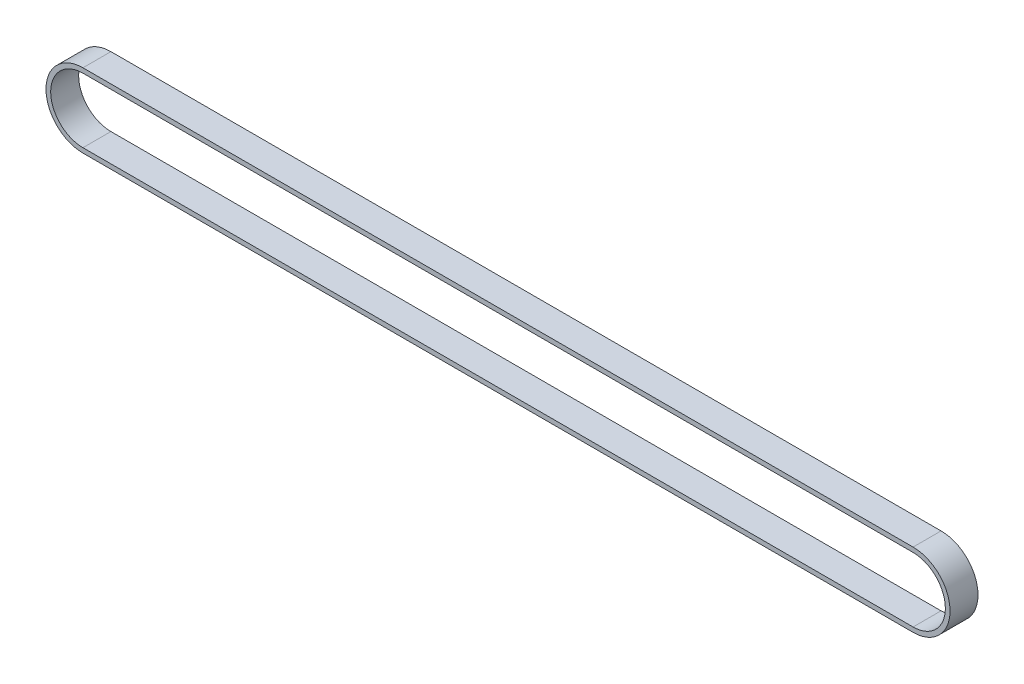
ISO-10303-21;
HEADER;
FILE_DESCRIPTION(('STEP AP214'),'2;1');
FILE_NAME('part.step','',(''),(''),'','','');
FILE_SCHEMA(('AUTOMOTIVE_DESIGN { 1 0 10303 214 1 1 1 1 }'));
ENDSEC;
DATA;
#1=APPLICATION_CONTEXT('core data for automotive mechanical design processes');
#2=APPLICATION_PROTOCOL_DEFINITION('international standard','automotive_design',2000,#1);
#3=PRODUCT_CONTEXT('',#1,'mechanical');
#4=PRODUCT('Part','Part','',(#3));
#5=PRODUCT_RELATED_PRODUCT_CATEGORY('part','',(#4));
#6=PRODUCT_DEFINITION_FORMATION('','',#4);
#7=PRODUCT_DEFINITION_CONTEXT('part definition',#1,'design');
#8=PRODUCT_DEFINITION('design','',#6,#7);
#9=PRODUCT_DEFINITION_SHAPE('','',#8);
#10=(LENGTH_UNIT() NAMED_UNIT(*) SI_UNIT(.MILLI.,.METRE.));
#11=(NAMED_UNIT(*) PLANE_ANGLE_UNIT() SI_UNIT($,.RADIAN.));
#12=(NAMED_UNIT(*) SI_UNIT($,.STERADIAN.) SOLID_ANGLE_UNIT());
#13=UNCERTAINTY_MEASURE_WITH_UNIT(LENGTH_MEASURE(1.E-05),#10,'distance_accuracy_value','');
#14=(GEOMETRIC_REPRESENTATION_CONTEXT(3) GLOBAL_UNCERTAINTY_ASSIGNED_CONTEXT((#13)) GLOBAL_UNIT_ASSIGNED_CONTEXT((#10,
#11,#12)) REPRESENTATION_CONTEXT('',''));
#15=CARTESIAN_POINT('',(0.,0.,0.));
#16=DIRECTION('',(0.,0.,1.));
#17=DIRECTION('',(1.,0.,0.));
#18=AXIS2_PLACEMENT_3D('',#15,#16,#17);
#19=CARTESIAN_POINT('',(-89.,-6.92,6.));
#20=DIRECTION('',(0.,0.,1.));
#21=DIRECTION('',(1.,0.,0.));
#22=AXIS2_PLACEMENT_3D('',#19,#20,#21);
#23=PLANE('',#22);
#24=CARTESIAN_POINT('',(-89.,-6.92,6.));
#25=DIRECTION('',(0.,0.,1.));
#26=DIRECTION('',(1.,0.,0.));
#27=AXIS2_PLACEMENT_3D('',#24,#25,#26);
#28=CIRCLE('',#27,7.92);
#29=CARTESIAN_POINT('',(-89.,1.,6.));
#30=VERTEX_POINT('',#29);
#31=CARTESIAN_POINT('',(-89.,-14.84,6.));
#32=VERTEX_POINT('',#31);
#33=EDGE_CURVE('E157',#30,#32,#28,.T.);
#34=ORIENTED_EDGE('',*,*,#33,.T.);
#35=DIRECTION('',(1.,0.,0.));
#36=VECTOR('',#35,1.);
#37=CARTESIAN_POINT('',(89.,-14.84,6.));
#38=LINE('',#37,#36);
#39=CARTESIAN_POINT('',(89.,-14.84,6.));
#40=VERTEX_POINT('',#39);
#41=EDGE_CURVE('E161',#32,#40,#38,.T.);
#42=ORIENTED_EDGE('',*,*,#41,.T.);
#43=CARTESIAN_POINT('',(89.,-6.91999999999999,6.));
#44=DIRECTION('',(0.,0.,1.));
#45=DIRECTION('',(-1.,0.,0.));
#46=AXIS2_PLACEMENT_3D('',#43,#44,#45);
#47=CIRCLE('',#46,7.91999999999999);
#48=CARTESIAN_POINT('',(89.,1.,6.));
#49=VERTEX_POINT('',#48);
#50=EDGE_CURVE('E165',#40,#49,#47,.T.);
#51=ORIENTED_EDGE('',*,*,#50,.T.);
#52=DIRECTION('',(-1.,0.,0.));
#53=VECTOR('',#52,1.);
#54=CARTESIAN_POINT('',(-89.,1.,6.));
#55=LINE('',#54,#53);
#56=EDGE_CURVE('E168',#49,#30,#55,.T.);
#57=ORIENTED_EDGE('',*,*,#56,.T.);
#58=EDGE_LOOP('',(#34,#42,#51,#57));
#59=FACE_BOUND('',#58,.T.);
#60=DIRECTION('',(-1.,0.,0.));
#61=VECTOR('',#60,1.);
#62=CARTESIAN_POINT('',(-89.,0.,6.));
#63=LINE('',#62,#61);
#64=CARTESIAN_POINT('',(89.,0.,6.));
#65=VERTEX_POINT('',#64);
#66=CARTESIAN_POINT('',(-89.,0.,6.));
#67=VERTEX_POINT('',#66);
#68=EDGE_CURVE('E118',#65,#67,#63,.T.);
#69=ORIENTED_EDGE('',*,*,#68,.F.);
#70=CARTESIAN_POINT('',(89.,-6.91999999999999,6.));
#71=DIRECTION('',(0.,0.,1.));
#72=DIRECTION('',(-1.,0.,0.));
#73=AXIS2_PLACEMENT_3D('',#70,#71,#72);
#74=CIRCLE('',#73,6.91999999999999);
#75=CARTESIAN_POINT('',(89.,-13.84,6.));
#76=VERTEX_POINT('',#75);
#77=EDGE_CURVE('E109',#76,#65,#74,.T.);
#78=ORIENTED_EDGE('',*,*,#77,.F.);
#79=DIRECTION('',(1.,0.,0.));
#80=VECTOR('',#79,1.);
#81=CARTESIAN_POINT('',(89.,-13.84,6.));
#82=LINE('',#81,#80);
#83=CARTESIAN_POINT('',(-89.,-13.84,6.));
#84=VERTEX_POINT('',#83);
#85=EDGE_CURVE('E135',#84,#76,#82,.T.);
#86=ORIENTED_EDGE('',*,*,#85,.F.);
#87=CARTESIAN_POINT('',(-89.,-6.92,6.));
#88=DIRECTION('',(0.,0.,1.));
#89=DIRECTION('',(1.,0.,0.));
#90=AXIS2_PLACEMENT_3D('',#87,#88,#89);
#91=CIRCLE('',#90,6.92);
#92=EDGE_CURVE('E131',#67,#84,#91,.T.);
#93=ORIENTED_EDGE('',*,*,#92,.F.);
#94=EDGE_LOOP('',(#69,#78,#86,#93));
#95=FACE_BOUND('',#94,.T.);
#96=ADVANCED_FACE('F43',(#59,#95),#23,.T.);
#97=CARTESIAN_POINT('',(-89.,-6.92,0.));
#98=DIRECTION('',(0.,0.,1.));
#99=DIRECTION('',(1.,0.,0.));
#100=AXIS2_PLACEMENT_3D('',#97,#98,#99);
#101=PLANE('',#100);
#102=CARTESIAN_POINT('',(-89.,-6.92,0.));
#103=DIRECTION('',(0.,0.,1.));
#104=DIRECTION('',(1.,0.,0.));
#105=AXIS2_PLACEMENT_3D('',#102,#103,#104);
#106=CIRCLE('',#105,7.92);
#107=CARTESIAN_POINT('',(-89.,1.,0.));
#108=VERTEX_POINT('',#107);
#109=CARTESIAN_POINT('',(-89.,-14.84,0.));
#110=VERTEX_POINT('',#109);
#111=EDGE_CURVE('E127',#108,#110,#106,.T.);
#112=ORIENTED_EDGE('',*,*,#111,.F.);
#113=DIRECTION('',(-1.,0.,0.));
#114=VECTOR('',#113,1.);
#115=CARTESIAN_POINT('',(-89.,1.,0.));
#116=LINE('',#115,#114);
#117=CARTESIAN_POINT('',(89.,1.,0.));
#118=VERTEX_POINT('',#117);
#119=EDGE_CURVE('E162',#118,#108,#116,.T.);
#120=ORIENTED_EDGE('',*,*,#119,.F.);
#121=CARTESIAN_POINT('',(89.,-6.91999999999999,0.));
#122=DIRECTION('',(0.,0.,1.));
#123=DIRECTION('',(-1.,0.,0.));
#124=AXIS2_PLACEMENT_3D('',#121,#122,#123);
#125=CIRCLE('',#124,7.91999999999999);
#126=CARTESIAN_POINT('',(89.,-14.84,0.));
#127=VERTEX_POINT('',#126);
#128=EDGE_CURVE('E178',#127,#118,#125,.T.);
#129=ORIENTED_EDGE('',*,*,#128,.F.);
#130=DIRECTION('',(1.,0.,0.));
#131=VECTOR('',#130,1.);
#132=CARTESIAN_POINT('',(89.,-14.84,0.));
#133=LINE('',#132,#131);
#134=EDGE_CURVE('E175',#110,#127,#133,.T.);
#135=ORIENTED_EDGE('',*,*,#134,.F.);
#136=EDGE_LOOP('',(#112,#120,#129,#135));
#137=FACE_BOUND('',#136,.T.);
#138=CARTESIAN_POINT('',(89.,-6.91999999999999,0.));
#139=DIRECTION('',(0.,0.,1.));
#140=DIRECTION('',(-1.,0.,0.));
#141=AXIS2_PLACEMENT_3D('',#138,#139,#140);
#142=CIRCLE('',#141,6.91999999999999);
#143=CARTESIAN_POINT('',(89.,-13.84,0.));
#144=VERTEX_POINT('',#143);
#145=CARTESIAN_POINT('',(89.,0.,0.));
#146=VERTEX_POINT('',#145);
#147=EDGE_CURVE('E67',#144,#146,#142,.T.);
#148=ORIENTED_EDGE('',*,*,#147,.T.);
#149=DIRECTION('',(-1.,0.,0.));
#150=VECTOR('',#149,1.);
#151=CARTESIAN_POINT('',(-89.,0.,0.));
#152=LINE('',#151,#150);
#153=CARTESIAN_POINT('',(-89.,0.,0.));
#154=VERTEX_POINT('',#153);
#155=EDGE_CURVE('E125',#146,#154,#152,.T.);
#156=ORIENTED_EDGE('',*,*,#155,.T.);
#157=CARTESIAN_POINT('',(-89.,-6.92,0.));
#158=DIRECTION('',(0.,0.,1.));
#159=DIRECTION('',(1.,0.,0.));
#160=AXIS2_PLACEMENT_3D('',#157,#158,#159);
#161=CIRCLE('',#160,6.92);
#162=CARTESIAN_POINT('',(-89.,-13.84,0.));
#163=VERTEX_POINT('',#162);
#164=EDGE_CURVE('E144',#154,#163,#161,.T.);
#165=ORIENTED_EDGE('',*,*,#164,.T.);
#166=DIRECTION('',(1.,0.,0.));
#167=VECTOR('',#166,1.);
#168=CARTESIAN_POINT('',(89.,-13.84,0.));
#169=LINE('',#168,#167);
#170=EDGE_CURVE('E119',#163,#144,#169,.T.);
#171=ORIENTED_EDGE('',*,*,#170,.T.);
#172=EDGE_LOOP('',(#148,#156,#165,#171));
#173=FACE_BOUND('',#172,.T.);
#174=ADVANCED_FACE('F201',(#137,#173),#101,.F.);
#175=CARTESIAN_POINT('',(-89.,-6.92,6.));
#176=DIRECTION('',(0.,0.,-1.));
#177=DIRECTION('',(-1.,0.,0.));
#178=AXIS2_PLACEMENT_3D('',#175,#176,#177);
#179=CYLINDRICAL_SURFACE('',#178,7.92);
#180=ORIENTED_EDGE('',*,*,#111,.T.);
#181=DIRECTION('',(0.,0.,-1.));
#182=VECTOR('',#181,1.);
#183=CARTESIAN_POINT('',(-89.,-14.84,6.));
#184=LINE('',#183,#182);
#185=EDGE_CURVE('E11',#32,#110,#184,.T.);
#186=ORIENTED_EDGE('',*,*,#185,.F.);
#187=ORIENTED_EDGE('',*,*,#33,.F.);
#188=DIRECTION('',(0.,0.,-1.));
#189=VECTOR('',#188,1.);
#190=CARTESIAN_POINT('',(-89.,1.,6.));
#191=LINE('',#190,#189);
#192=EDGE_CURVE('E171',#30,#108,#191,.T.);
#193=ORIENTED_EDGE('',*,*,#192,.T.);
#194=EDGE_LOOP('',(#180,#186,#187,#193));
#195=FACE_BOUND('',#194,.T.);
#196=ADVANCED_FACE('F45',(#195),#179,.T.);
#197=CARTESIAN_POINT('',(89.,-14.84,6.));
#198=DIRECTION('',(0.,1.,0.));
#199=DIRECTION('',(-1.,0.,0.));
#200=AXIS2_PLACEMENT_3D('',#197,#198,#199);
#201=PLANE('',#200);
#202=ORIENTED_EDGE('',*,*,#134,.T.);
#203=DIRECTION('',(0.,0.,-1.));
#204=VECTOR('',#203,1.);
#205=CARTESIAN_POINT('',(89.,-14.84,6.));
#206=LINE('',#205,#204);
#207=EDGE_CURVE('E52',#40,#127,#206,.T.);
#208=ORIENTED_EDGE('',*,*,#207,.F.);
#209=ORIENTED_EDGE('',*,*,#41,.F.);
#210=ORIENTED_EDGE('',*,*,#185,.T.);
#211=EDGE_LOOP('',(#202,#208,#209,#210));
#212=FACE_BOUND('',#211,.T.);
#213=ADVANCED_FACE('F211',(#212),#201,.F.);
#214=CARTESIAN_POINT('',(89.,-6.91999999999999,6.));
#215=DIRECTION('',(0.,0.,-1.));
#216=DIRECTION('',(-1.,0.,0.));
#217=AXIS2_PLACEMENT_3D('',#214,#215,#216);
#218=CYLINDRICAL_SURFACE('',#217,7.91999999999999);
#219=ORIENTED_EDGE('',*,*,#128,.T.);
#220=DIRECTION('',(0.,0.,-1.));
#221=VECTOR('',#220,1.);
#222=CARTESIAN_POINT('',(89.,1.,6.));
#223=LINE('',#222,#221);
#224=EDGE_CURVE('E186',#49,#118,#223,.T.);
#225=ORIENTED_EDGE('',*,*,#224,.F.);
#226=ORIENTED_EDGE('',*,*,#50,.F.);
#227=ORIENTED_EDGE('',*,*,#207,.T.);
#228=EDGE_LOOP('',(#219,#225,#226,#227));
#229=FACE_BOUND('',#228,.T.);
#230=ADVANCED_FACE('F195',(#229),#218,.T.);
#231=CARTESIAN_POINT('',(-89.,1.,6.));
#232=DIRECTION('',(0.,-1.,0.));
#233=DIRECTION('',(0.,0.,-1.));
#234=AXIS2_PLACEMENT_3D('',#231,#232,#233);
#235=PLANE('',#234);
#236=ORIENTED_EDGE('',*,*,#119,.T.);
#237=ORIENTED_EDGE('',*,*,#192,.F.);
#238=ORIENTED_EDGE('',*,*,#56,.F.);
#239=ORIENTED_EDGE('',*,*,#224,.T.);
#240=EDGE_LOOP('',(#236,#237,#238,#239));
#241=FACE_BOUND('',#240,.T.);
#242=ADVANCED_FACE('F205',(#241),#235,.F.);
#243=CARTESIAN_POINT('',(89.,-6.91999999999999,6.));
#244=DIRECTION('',(0.,0.,-1.));
#245=DIRECTION('',(-1.,0.,0.));
#246=AXIS2_PLACEMENT_3D('',#243,#244,#245);
#247=CYLINDRICAL_SURFACE('',#246,6.91999999999999);
#248=ORIENTED_EDGE('',*,*,#147,.F.);
#249=DIRECTION('',(0.,0.,-1.));
#250=VECTOR('',#249,1.);
#251=CARTESIAN_POINT('',(89.,-13.84,6.));
#252=LINE('',#251,#250);
#253=EDGE_CURVE('E113',#76,#144,#252,.T.);
#254=ORIENTED_EDGE('',*,*,#253,.F.);
#255=ORIENTED_EDGE('',*,*,#77,.T.);
#256=DIRECTION('',(0.,0.,-1.));
#257=VECTOR('',#256,1.);
#258=CARTESIAN_POINT('',(89.,0.,6.));
#259=LINE('',#258,#257);
#260=EDGE_CURVE('E112',#65,#146,#259,.T.);
#261=ORIENTED_EDGE('',*,*,#260,.T.);
#262=EDGE_LOOP('',(#248,#254,#255,#261));
#263=FACE_BOUND('',#262,.T.);
#264=ADVANCED_FACE('F111',(#263),#247,.F.);
#265=CARTESIAN_POINT('',(-89.,0.,6.));
#266=DIRECTION('',(0.,-1.,0.));
#267=DIRECTION('',(0.,0.,-1.));
#268=AXIS2_PLACEMENT_3D('',#265,#266,#267);
#269=PLANE('',#268);
#270=ORIENTED_EDGE('',*,*,#155,.F.);
#271=ORIENTED_EDGE('',*,*,#260,.F.);
#272=ORIENTED_EDGE('',*,*,#68,.T.);
#273=DIRECTION('',(0.,0.,-1.));
#274=VECTOR('',#273,1.);
#275=CARTESIAN_POINT('',(-89.,0.,6.));
#276=LINE('',#275,#274);
#277=EDGE_CURVE('E128',#67,#154,#276,.T.);
#278=ORIENTED_EDGE('',*,*,#277,.T.);
#279=EDGE_LOOP('',(#270,#271,#272,#278));
#280=FACE_BOUND('',#279,.T.);
#281=ADVANCED_FACE('F122',(#280),#269,.T.);
#282=CARTESIAN_POINT('',(-89.,-6.92,6.));
#283=DIRECTION('',(0.,0.,-1.));
#284=DIRECTION('',(-1.,0.,0.));
#285=AXIS2_PLACEMENT_3D('',#282,#283,#284);
#286=CYLINDRICAL_SURFACE('',#285,6.92);
#287=ORIENTED_EDGE('',*,*,#164,.F.);
#288=ORIENTED_EDGE('',*,*,#277,.F.);
#289=ORIENTED_EDGE('',*,*,#92,.T.);
#290=DIRECTION('',(0.,0.,-1.));
#291=VECTOR('',#290,1.);
#292=CARTESIAN_POINT('',(-89.,-13.84,6.));
#293=LINE('',#292,#291);
#294=EDGE_CURVE('E59',#84,#163,#293,.T.);
#295=ORIENTED_EDGE('',*,*,#294,.T.);
#296=EDGE_LOOP('',(#287,#288,#289,#295));
#297=FACE_BOUND('',#296,.T.);
#298=ADVANCED_FACE('F234',(#297),#286,.F.);
#299=CARTESIAN_POINT('',(89.,-13.84,6.));
#300=DIRECTION('',(0.,1.,0.));
#301=DIRECTION('',(-1.,0.,0.));
#302=AXIS2_PLACEMENT_3D('',#299,#300,#301);
#303=PLANE('',#302);
#304=ORIENTED_EDGE('',*,*,#170,.F.);
#305=ORIENTED_EDGE('',*,*,#294,.F.);
#306=ORIENTED_EDGE('',*,*,#85,.T.);
#307=ORIENTED_EDGE('',*,*,#253,.T.);
#308=EDGE_LOOP('',(#304,#305,#306,#307));
#309=FACE_BOUND('',#308,.T.);
#310=ADVANCED_FACE('F238',(#309),#303,.T.);
#311=CLOSED_SHELL('',(#96,#174,#196,#213,#230,#242,#264,#281,#298,#310));
#312=MANIFOLD_SOLID_BREP('B2',#311);
#313=ADVANCED_BREP_SHAPE_REPRESENTATION('',(#18,#312),#14);
#314=SHAPE_DEFINITION_REPRESENTATION(#9,#313);
ENDSEC;
END-ISO-10303-21;
